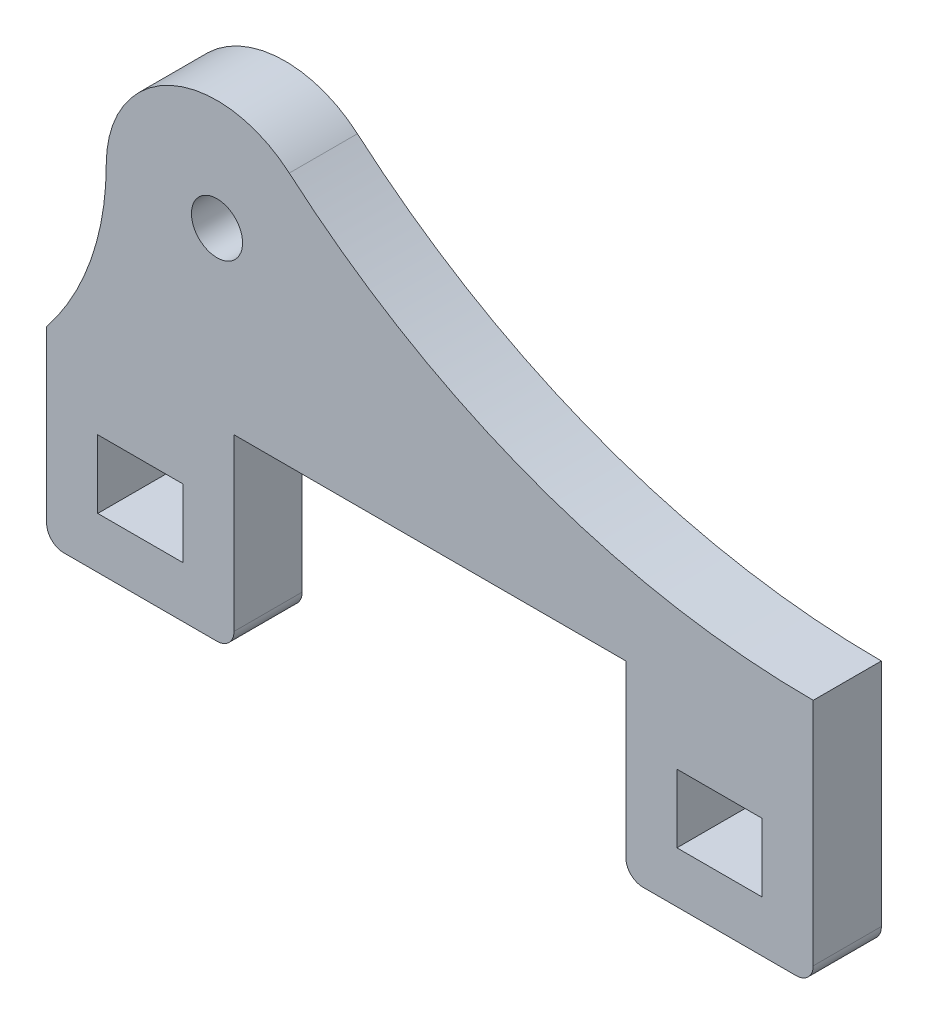
ISO-10303-21;
HEADER;
FILE_DESCRIPTION(('STEP AP214'),'2;1');
FILE_NAME('part.step','',(''),(''),'','','');
FILE_SCHEMA(('AUTOMOTIVE_DESIGN { 1 0 10303 214 1 1 1 1 }'));
ENDSEC;
DATA;
#1=APPLICATION_CONTEXT('core data for automotive mechanical design processes');
#2=APPLICATION_PROTOCOL_DEFINITION('international standard','automotive_design',2000,#1);
#3=PRODUCT_CONTEXT('',#1,'mechanical');
#4=PRODUCT('Part','Part','',(#3));
#5=PRODUCT_RELATED_PRODUCT_CATEGORY('part','',(#4));
#6=PRODUCT_DEFINITION_FORMATION('','',#4);
#7=PRODUCT_DEFINITION_CONTEXT('part definition',#1,'design');
#8=PRODUCT_DEFINITION('design','',#6,#7);
#9=PRODUCT_DEFINITION_SHAPE('','',#8);
#10=(LENGTH_UNIT() NAMED_UNIT(*) SI_UNIT(.MILLI.,.METRE.));
#11=(NAMED_UNIT(*) PLANE_ANGLE_UNIT() SI_UNIT($,.RADIAN.));
#12=(NAMED_UNIT(*) SI_UNIT($,.STERADIAN.) SOLID_ANGLE_UNIT());
#13=UNCERTAINTY_MEASURE_WITH_UNIT(LENGTH_MEASURE(1.E-05),#10,'distance_accuracy_value','');
#14=(GEOMETRIC_REPRESENTATION_CONTEXT(3) GLOBAL_UNCERTAINTY_ASSIGNED_CONTEXT((#13)) GLOBAL_UNIT_ASSIGNED_CONTEXT((#10,
#11,#12)) REPRESENTATION_CONTEXT('',''));
#15=CARTESIAN_POINT('',(0.,0.,0.));
#16=DIRECTION('',(0.,0.,1.));
#17=DIRECTION('',(1.,0.,0.));
#18=AXIS2_PLACEMENT_3D('',#15,#16,#17);
#19=CARTESIAN_POINT('',(0.,-4.,4.));
#20=DIRECTION('',(0.,1.,0.));
#21=DIRECTION('',(0.,0.,1.));
#22=AXIS2_PLACEMENT_3D('',#19,#20,#21);
#23=PLANE('',#22);
#24=DIRECTION('',(1.,0.,0.));
#25=VECTOR('',#24,1.);
#26=CARTESIAN_POINT('',(0.,-4.,0.));
#27=LINE('',#26,#25);
#28=CARTESIAN_POINT('',(3.,-4.,0.));
#29=VERTEX_POINT('',#28);
#30=CARTESIAN_POINT('',(8.,-4.,0.));
#31=VERTEX_POINT('',#30);
#32=EDGE_CURVE('E345',#29,#31,#27,.T.);
#33=ORIENTED_EDGE('',*,*,#32,.T.);
#34=DIRECTION('',(0.,0.,-1.));
#35=VECTOR('',#34,1.);
#36=CARTESIAN_POINT('',(8.,-4.,4.));
#37=LINE('',#36,#35);
#38=CARTESIAN_POINT('',(8.,-4.,4.));
#39=VERTEX_POINT('',#38);
#40=EDGE_CURVE('E239',#39,#31,#37,.T.);
#41=ORIENTED_EDGE('',*,*,#40,.F.);
#42=DIRECTION('',(1.,0.,0.));
#43=VECTOR('',#42,1.);
#44=CARTESIAN_POINT('',(0.,-4.,4.));
#45=LINE('',#44,#43);
#46=CARTESIAN_POINT('',(3.,-4.,4.));
#47=VERTEX_POINT('',#46);
#48=EDGE_CURVE('E443',#47,#39,#45,.T.);
#49=ORIENTED_EDGE('',*,*,#48,.F.);
#50=DIRECTION('',(0.,0.,-1.));
#51=VECTOR('',#50,1.);
#52=CARTESIAN_POINT('',(3.,-4.,4.));
#53=LINE('',#52,#51);
#54=EDGE_CURVE('E361',#47,#29,#53,.T.);
#55=ORIENTED_EDGE('',*,*,#54,.T.);
#56=EDGE_LOOP('',(#33,#41,#49,#55));
#57=FACE_BOUND('',#56,.T.);
#58=ADVANCED_FACE('F41',(#57),#23,.F.);
#59=CARTESIAN_POINT('',(8.,0.,4.));
#60=DIRECTION('',(1.,0.,0.));
#61=DIRECTION('',(0.,0.,-1.));
#62=AXIS2_PLACEMENT_3D('',#59,#60,#61);
#63=PLANE('',#62);
#64=DIRECTION('',(0.,-1.,0.));
#65=VECTOR('',#64,1.);
#66=CARTESIAN_POINT('',(8.,0.,0.));
#67=LINE('',#66,#65);
#68=CARTESIAN_POINT('',(8.,-8.,0.));
#69=VERTEX_POINT('',#68);
#70=EDGE_CURVE('E349',#31,#69,#67,.T.);
#71=ORIENTED_EDGE('',*,*,#70,.T.);
#72=DIRECTION('',(0.,0.,-1.));
#73=VECTOR('',#72,1.);
#74=CARTESIAN_POINT('',(8.,-8.,4.));
#75=LINE('',#74,#73);
#76=CARTESIAN_POINT('',(8.,-8.,4.));
#77=VERTEX_POINT('',#76);
#78=EDGE_CURVE('E368',#77,#69,#75,.T.);
#79=ORIENTED_EDGE('',*,*,#78,.F.);
#80=DIRECTION('',(0.,-1.,0.));
#81=VECTOR('',#80,1.);
#82=CARTESIAN_POINT('',(8.,0.,4.));
#83=LINE('',#82,#81);
#84=EDGE_CURVE('E447',#39,#77,#83,.T.);
#85=ORIENTED_EDGE('',*,*,#84,.F.);
#86=ORIENTED_EDGE('',*,*,#40,.T.);
#87=EDGE_LOOP('',(#71,#79,#85,#86));
#88=FACE_BOUND('',#87,.T.);
#89=ADVANCED_FACE('F484',(#88),#63,.F.);
#90=CARTESIAN_POINT('',(0.,-8.,4.));
#91=DIRECTION('',(0.,1.,0.));
#92=DIRECTION('',(0.,0.,1.));
#93=AXIS2_PLACEMENT_3D('',#90,#91,#92);
#94=PLANE('',#93);
#95=DIRECTION('',(1.,0.,0.));
#96=VECTOR('',#95,1.);
#97=CARTESIAN_POINT('',(0.,-8.,0.));
#98=LINE('',#97,#96);
#99=CARTESIAN_POINT('',(3.,-8.,0.));
#100=VERTEX_POINT('',#99);
#101=EDGE_CURVE('E353',#100,#69,#98,.T.);
#102=ORIENTED_EDGE('',*,*,#101,.F.);
#103=DIRECTION('',(0.,0.,-1.));
#104=VECTOR('',#103,1.);
#105=CARTESIAN_POINT('',(3.,-8.,4.));
#106=LINE('',#105,#104);
#107=CARTESIAN_POINT('',(3.,-8.,4.));
#108=VERTEX_POINT('',#107);
#109=EDGE_CURVE('E364',#108,#100,#106,.T.);
#110=ORIENTED_EDGE('',*,*,#109,.F.);
#111=DIRECTION('',(1.,0.,0.));
#112=VECTOR('',#111,1.);
#113=CARTESIAN_POINT('',(0.,-8.,4.));
#114=LINE('',#113,#112);
#115=EDGE_CURVE('E450',#108,#77,#114,.T.);
#116=ORIENTED_EDGE('',*,*,#115,.T.);
#117=ORIENTED_EDGE('',*,*,#78,.T.);
#118=EDGE_LOOP('',(#102,#110,#116,#117));
#119=FACE_BOUND('',#118,.T.);
#120=ADVANCED_FACE('F490',(#119),#94,.T.);
#121=CARTESIAN_POINT('',(0.,-4.,4.));
#122=DIRECTION('',(0.,1.,0.));
#123=DIRECTION('',(0.,0.,1.));
#124=AXIS2_PLACEMENT_3D('',#121,#122,#123);
#125=PLANE('',#124);
#126=DIRECTION('',(1.,0.,0.));
#127=VECTOR('',#126,1.);
#128=CARTESIAN_POINT('',(0.,-4.,0.));
#129=LINE('',#128,#127);
#130=CARTESIAN_POINT('',(37.,-4.,0.));
#131=VERTEX_POINT('',#130);
#132=CARTESIAN_POINT('',(42.,-4.,0.));
#133=VERTEX_POINT('',#132);
#134=EDGE_CURVE('E329',#131,#133,#129,.T.);
#135=ORIENTED_EDGE('',*,*,#134,.T.);
#136=DIRECTION('',(0.,0.,-1.));
#137=VECTOR('',#136,1.);
#138=CARTESIAN_POINT('',(42.,-4.,4.));
#139=LINE('',#138,#137);
#140=CARTESIAN_POINT('',(42.,-4.,4.));
#141=VERTEX_POINT('',#140);
#142=EDGE_CURVE('E365',#141,#133,#139,.T.);
#143=ORIENTED_EDGE('',*,*,#142,.F.);
#144=DIRECTION('',(1.,0.,0.));
#145=VECTOR('',#144,1.);
#146=CARTESIAN_POINT('',(0.,-4.,4.));
#147=LINE('',#146,#145);
#148=CARTESIAN_POINT('',(37.,-4.,4.));
#149=VERTEX_POINT('',#148);
#150=EDGE_CURVE('E428',#149,#141,#147,.T.);
#151=ORIENTED_EDGE('',*,*,#150,.F.);
#152=DIRECTION('',(0.,0.,-1.));
#153=VECTOR('',#152,1.);
#154=CARTESIAN_POINT('',(37.,-4.,4.));
#155=LINE('',#154,#153);
#156=EDGE_CURVE('E224',#149,#131,#155,.T.);
#157=ORIENTED_EDGE('',*,*,#156,.T.);
#158=EDGE_LOOP('',(#135,#143,#151,#157));
#159=FACE_BOUND('',#158,.T.);
#160=ADVANCED_FACE('F506',(#159),#125,.F.);
#161=CARTESIAN_POINT('',(42.,0.,4.));
#162=DIRECTION('',(1.,0.,0.));
#163=DIRECTION('',(0.,0.,-1.));
#164=AXIS2_PLACEMENT_3D('',#161,#162,#163);
#165=PLANE('',#164);
#166=DIRECTION('',(0.,-1.,0.));
#167=VECTOR('',#166,1.);
#168=CARTESIAN_POINT('',(42.,0.,0.));
#169=LINE('',#168,#167);
#170=CARTESIAN_POINT('',(42.,-8.,0.));
#171=VERTEX_POINT('',#170);
#172=EDGE_CURVE('E333',#133,#171,#169,.T.);
#173=ORIENTED_EDGE('',*,*,#172,.T.);
#174=DIRECTION('',(0.,0.,-1.));
#175=VECTOR('',#174,1.);
#176=CARTESIAN_POINT('',(42.,-8.,4.));
#177=LINE('',#176,#175);
#178=CARTESIAN_POINT('',(42.,-8.,4.));
#179=VERTEX_POINT('',#178);
#180=EDGE_CURVE('E376',#179,#171,#177,.T.);
#181=ORIENTED_EDGE('',*,*,#180,.F.);
#182=DIRECTION('',(0.,-1.,0.));
#183=VECTOR('',#182,1.);
#184=CARTESIAN_POINT('',(42.,0.,4.));
#185=LINE('',#184,#183);
#186=EDGE_CURVE('E432',#141,#179,#185,.T.);
#187=ORIENTED_EDGE('',*,*,#186,.F.);
#188=ORIENTED_EDGE('',*,*,#142,.T.);
#189=EDGE_LOOP('',(#173,#181,#187,#188));
#190=FACE_BOUND('',#189,.T.);
#191=ADVANCED_FACE('F502',(#190),#165,.F.);
#192=CARTESIAN_POINT('',(0.,-8.,4.));
#193=DIRECTION('',(0.,1.,0.));
#194=DIRECTION('',(0.,0.,1.));
#195=AXIS2_PLACEMENT_3D('',#192,#193,#194);
#196=PLANE('',#195);
#197=DIRECTION('',(1.,0.,0.));
#198=VECTOR('',#197,1.);
#199=CARTESIAN_POINT('',(0.,-8.,0.));
#200=LINE('',#199,#198);
#201=CARTESIAN_POINT('',(37.,-8.,0.));
#202=VERTEX_POINT('',#201);
#203=EDGE_CURVE('E337',#202,#171,#200,.T.);
#204=ORIENTED_EDGE('',*,*,#203,.F.);
#205=DIRECTION('',(0.,0.,-1.));
#206=VECTOR('',#205,1.);
#207=CARTESIAN_POINT('',(37.,-8.,4.));
#208=LINE('',#207,#206);
#209=CARTESIAN_POINT('',(37.,-8.,4.));
#210=VERTEX_POINT('',#209);
#211=EDGE_CURVE('E228',#210,#202,#208,.T.);
#212=ORIENTED_EDGE('',*,*,#211,.F.);
#213=DIRECTION('',(1.,0.,0.));
#214=VECTOR('',#213,1.);
#215=CARTESIAN_POINT('',(0.,-8.,4.));
#216=LINE('',#215,#214);
#217=EDGE_CURVE('E435',#210,#179,#216,.T.);
#218=ORIENTED_EDGE('',*,*,#217,.T.);
#219=ORIENTED_EDGE('',*,*,#180,.T.);
#220=EDGE_LOOP('',(#204,#212,#218,#219));
#221=FACE_BOUND('',#220,.T.);
#222=ADVANCED_FACE('F499',(#221),#196,.T.);
#223=CARTESIAN_POINT('',(10.,10.,4.));
#224=DIRECTION('',(0.,0.,-1.));
#225=DIRECTION('',(-1.,0.,0.));
#226=AXIS2_PLACEMENT_3D('',#223,#224,#225);
#227=CYLINDRICAL_SURFACE('',#226,6.5);
#228=CARTESIAN_POINT('',(10.,10.,0.));
#229=DIRECTION('',(0.,0.,1.));
#230=DIRECTION('',(1.,0.,0.));
#231=AXIS2_PLACEMENT_3D('',#228,#229,#230);
#232=CIRCLE('',#231,6.5);
#233=CARTESIAN_POINT('',(14.2431850789096,14.9239598278336,0.));
#234=VERTEX_POINT('',#233);
#235=CARTESIAN_POINT('',(3.5,10.,0.));
#236=VERTEX_POINT('',#235);
#237=EDGE_CURVE('E222',#234,#236,#232,.T.);
#238=ORIENTED_EDGE('',*,*,#237,.T.);
#239=DIRECTION('',(0.,0.,-1.));
#240=VECTOR('',#239,1.);
#241=CARTESIAN_POINT('',(3.5,10.,4.));
#242=LINE('',#241,#240);
#243=CARTESIAN_POINT('',(3.5,10.,4.));
#244=VERTEX_POINT('',#243);
#245=EDGE_CURVE('E198',#244,#236,#242,.T.);
#246=ORIENTED_EDGE('',*,*,#245,.F.);
#247=CARTESIAN_POINT('',(10.,10.,4.));
#248=DIRECTION('',(0.,0.,1.));
#249=DIRECTION('',(1.,0.,0.));
#250=AXIS2_PLACEMENT_3D('',#247,#248,#249);
#251=CIRCLE('',#250,6.5);
#252=CARTESIAN_POINT('',(14.2431850789096,14.9239598278336,4.));
#253=VERTEX_POINT('',#252);
#254=EDGE_CURVE('E206',#253,#244,#251,.T.);
#255=ORIENTED_EDGE('',*,*,#254,.F.);
#256=DIRECTION('',(0.,0.,-1.));
#257=VECTOR('',#256,1.);
#258=CARTESIAN_POINT('',(14.2431850789096,14.9239598278336,4.));
#259=LINE('',#258,#257);
#260=EDGE_CURVE('E382',#253,#234,#259,.T.);
#261=ORIENTED_EDGE('',*,*,#260,.T.);
#262=EDGE_LOOP('',(#238,#246,#255,#261));
#263=FACE_BOUND('',#262,.T.);
#264=ADVANCED_FACE('F220',(#263),#227,.T.);
#265=CARTESIAN_POINT('',(-12.5357142857143,9.99999999999999,4.));
#266=DIRECTION('',(0.,0.,-1.));
#267=DIRECTION('',(-1.,0.,0.));
#268=AXIS2_PLACEMENT_3D('',#265,#266,#267);
#269=CYLINDRICAL_SURFACE('',#268,16.0357142857143);
#270=CARTESIAN_POINT('',(-12.5357142857143,9.99999999999999,0.));
#271=DIRECTION('',(0.,0.,1.));
#272=DIRECTION('',(1.,0.,0.));
#273=AXIS2_PLACEMENT_3D('',#270,#271,#272);
#274=CIRCLE('',#273,16.0357142857143);
#275=CARTESIAN_POINT('',(0.,0.,0.));
#276=VERTEX_POINT('',#275);
#277=EDGE_CURVE('E310',#236,#276,#274,.F.);
#278=ORIENTED_EDGE('',*,*,#277,.T.);
#279=DIRECTION('',(0.,0.,-1.));
#280=VECTOR('',#279,1.);
#281=CARTESIAN_POINT('',(0.,0.,4.));
#282=LINE('',#281,#280);
#283=CARTESIAN_POINT('',(0.,0.,4.));
#284=VERTEX_POINT('',#283);
#285=EDGE_CURVE('E201',#284,#276,#282,.T.);
#286=ORIENTED_EDGE('',*,*,#285,.F.);
#287=CARTESIAN_POINT('',(-12.5357142857143,9.99999999999999,4.));
#288=DIRECTION('',(0.,0.,1.));
#289=DIRECTION('',(1.,0.,0.));
#290=AXIS2_PLACEMENT_3D('',#287,#288,#289);
#291=CIRCLE('',#290,16.0357142857143);
#292=EDGE_CURVE('E194',#244,#284,#291,.F.);
#293=ORIENTED_EDGE('',*,*,#292,.F.);
#294=ORIENTED_EDGE('',*,*,#245,.T.);
#295=EDGE_LOOP('',(#278,#286,#293,#294));
#296=FACE_BOUND('',#295,.T.);
#297=ADVANCED_FACE('F196',(#296),#269,.F.);
#298=CARTESIAN_POINT('',(0.,0.,4.));
#299=DIRECTION('',(1.,0.,0.));
#300=DIRECTION('',(0.,1.,0.));
#301=AXIS2_PLACEMENT_3D('',#298,#299,#300);
#302=PLANE('',#301);
#303=DIRECTION('',(0.,-1.,0.));
#304=VECTOR('',#303,1.);
#305=CARTESIAN_POINT('',(0.,0.,0.));
#306=LINE('',#305,#304);
#307=CARTESIAN_POINT('',(0.,-10.,0.));
#308=VERTEX_POINT('',#307);
#309=EDGE_CURVE('E283',#276,#308,#306,.T.);
#310=ORIENTED_EDGE('',*,*,#309,.T.);
#311=DIRECTION('',(0.,0.,-1.));
#312=VECTOR('',#311,1.);
#313=CARTESIAN_POINT('',(0.,-10.,4.));
#314=LINE('',#313,#312);
#315=CARTESIAN_POINT('',(0.,-10.,4.));
#316=VERTEX_POINT('',#315);
#317=EDGE_CURVE('E50',#308,#316,#314,.F.);
#318=ORIENTED_EDGE('',*,*,#317,.T.);
#319=DIRECTION('',(0.,-1.,0.));
#320=VECTOR('',#319,1.);
#321=CARTESIAN_POINT('',(0.,0.,4.));
#322=LINE('',#321,#320);
#323=EDGE_CURVE('E205',#284,#316,#322,.T.);
#324=ORIENTED_EDGE('',*,*,#323,.F.);
#325=ORIENTED_EDGE('',*,*,#285,.T.);
#326=EDGE_LOOP('',(#310,#318,#324,#325));
#327=FACE_BOUND('',#326,.T.);
#328=ADVANCED_FACE('F281',(#327),#302,.F.);
#329=CARTESIAN_POINT('',(0.,-11.,4.));
#330=DIRECTION('',(0.,1.,0.));
#331=DIRECTION('',(0.,0.,1.));
#332=AXIS2_PLACEMENT_3D('',#329,#330,#331);
#333=PLANE('',#332);
#334=DIRECTION('',(1.,0.,0.));
#335=VECTOR('',#334,1.);
#336=CARTESIAN_POINT('',(0.,-11.,4.));
#337=LINE('',#336,#335);
#338=CARTESIAN_POINT('',(1.,-11.,4.));
#339=VERTEX_POINT('',#338);
#340=CARTESIAN_POINT('',(10.,-11.,4.));
#341=VERTEX_POINT('',#340);
#342=EDGE_CURVE('E288',#339,#341,#337,.T.);
#343=ORIENTED_EDGE('',*,*,#342,.F.);
#344=DIRECTION('',(0.,0.,-1.));
#345=VECTOR('',#344,1.);
#346=CARTESIAN_POINT('',(1.,-11.,4.));
#347=LINE('',#346,#345);
#348=CARTESIAN_POINT('',(1.,-11.,0.));
#349=VERTEX_POINT('',#348);
#350=EDGE_CURVE('E274',#339,#349,#347,.T.);
#351=ORIENTED_EDGE('',*,*,#350,.T.);
#352=DIRECTION('',(1.,0.,0.));
#353=VECTOR('',#352,1.);
#354=CARTESIAN_POINT('',(0.,-11.,0.));
#355=LINE('',#354,#353);
#356=CARTESIAN_POINT('',(10.,-11.,0.));
#357=VERTEX_POINT('',#356);
#358=EDGE_CURVE('E296',#349,#357,#355,.T.);
#359=ORIENTED_EDGE('',*,*,#358,.T.);
#360=DIRECTION('',(0.,0.,-1.));
#361=VECTOR('',#360,1.);
#362=CARTESIAN_POINT('',(10.,-11.,4.));
#363=LINE('',#362,#361);
#364=EDGE_CURVE('E271',#357,#341,#363,.F.);
#365=ORIENTED_EDGE('',*,*,#364,.T.);
#366=EDGE_LOOP('',(#343,#351,#359,#365));
#367=FACE_BOUND('',#366,.T.);
#368=ADVANCED_FACE('F295',(#367),#333,.F.);
#369=CARTESIAN_POINT('',(11.,0.,4.));
#370=DIRECTION('',(-1.,0.,0.));
#371=DIRECTION('',(0.,0.,1.));
#372=AXIS2_PLACEMENT_3D('',#369,#370,#371);
#373=PLANE('',#372);
#374=DIRECTION('',(0.,1.,0.));
#375=VECTOR('',#374,1.);
#376=CARTESIAN_POINT('',(11.,0.,4.));
#377=LINE('',#376,#375);
#378=CARTESIAN_POINT('',(11.,-10.,4.));
#379=VERTEX_POINT('',#378);
#380=CARTESIAN_POINT('',(11.,0.,4.));
#381=VERTEX_POINT('',#380);
#382=EDGE_CURVE('E550',#379,#381,#377,.T.);
#383=ORIENTED_EDGE('',*,*,#382,.F.);
#384=DIRECTION('',(0.,0.,-1.));
#385=VECTOR('',#384,1.);
#386=CARTESIAN_POINT('',(11.,-10.,4.));
#387=LINE('',#386,#385);
#388=CARTESIAN_POINT('',(11.,-10.,0.));
#389=VERTEX_POINT('',#388);
#390=EDGE_CURVE('E11',#379,#389,#387,.T.);
#391=ORIENTED_EDGE('',*,*,#390,.T.);
#392=DIRECTION('',(0.,1.,0.));
#393=VECTOR('',#392,1.);
#394=CARTESIAN_POINT('',(11.,0.,0.));
#395=LINE('',#394,#393);
#396=CARTESIAN_POINT('',(11.,0.,0.));
#397=VERTEX_POINT('',#396);
#398=EDGE_CURVE('E304',#389,#397,#395,.T.);
#399=ORIENTED_EDGE('',*,*,#398,.T.);
#400=DIRECTION('',(0.,0.,-1.));
#401=VECTOR('',#400,1.);
#402=CARTESIAN_POINT('',(11.,0.,4.));
#403=LINE('',#402,#401);
#404=EDGE_CURVE('E230',#381,#397,#403,.T.);
#405=ORIENTED_EDGE('',*,*,#404,.F.);
#406=EDGE_LOOP('',(#383,#391,#399,#405));
#407=FACE_BOUND('',#406,.T.);
#408=ADVANCED_FACE('F522',(#407),#373,.F.);
#409=CARTESIAN_POINT('',(0.,0.,4.));
#410=DIRECTION('',(0.,1.,0.));
#411=DIRECTION('',(0.,0.,1.));
#412=AXIS2_PLACEMENT_3D('',#409,#410,#411);
#413=PLANE('',#412);
#414=DIRECTION('',(1.,0.,0.));
#415=VECTOR('',#414,1.);
#416=CARTESIAN_POINT('',(0.,0.,0.));
#417=LINE('',#416,#415);
#418=CARTESIAN_POINT('',(34.,0.,0.));
#419=VERTEX_POINT('',#418);
#420=EDGE_CURVE('E308',#397,#419,#417,.T.);
#421=ORIENTED_EDGE('',*,*,#420,.T.);
#422=DIRECTION('',(0.,0.,-1.));
#423=VECTOR('',#422,1.);
#424=CARTESIAN_POINT('',(34.,0.,4.));
#425=LINE('',#424,#423);
#426=CARTESIAN_POINT('',(34.,0.,4.));
#427=VERTEX_POINT('',#426);
#428=EDGE_CURVE('E390',#427,#419,#425,.T.);
#429=ORIENTED_EDGE('',*,*,#428,.F.);
#430=DIRECTION('',(1.,0.,0.));
#431=VECTOR('',#430,1.);
#432=CARTESIAN_POINT('',(0.,0.,4.));
#433=LINE('',#432,#431);
#434=EDGE_CURVE('E401',#381,#427,#433,.T.);
#435=ORIENTED_EDGE('',*,*,#434,.F.);
#436=ORIENTED_EDGE('',*,*,#404,.T.);
#437=EDGE_LOOP('',(#421,#429,#435,#436));
#438=FACE_BOUND('',#437,.T.);
#439=ADVANCED_FACE('F399',(#438),#413,.F.);
#440=CARTESIAN_POINT('',(34.,0.,4.));
#441=DIRECTION('',(1.,0.,0.));
#442=DIRECTION('',(0.,0.,-1.));
#443=AXIS2_PLACEMENT_3D('',#440,#441,#442);
#444=PLANE('',#443);
#445=DIRECTION('',(0.,-1.,0.));
#446=VECTOR('',#445,1.);
#447=CARTESIAN_POINT('',(34.,0.,0.));
#448=LINE('',#447,#446);
#449=CARTESIAN_POINT('',(34.,-10.,0.));
#450=VERTEX_POINT('',#449);
#451=EDGE_CURVE('E316',#419,#450,#448,.T.);
#452=ORIENTED_EDGE('',*,*,#451,.T.);
#453=DIRECTION('',(0.,0.,-1.));
#454=VECTOR('',#453,1.);
#455=CARTESIAN_POINT('',(34.,-10.,4.));
#456=LINE('',#455,#454);
#457=CARTESIAN_POINT('',(34.,-10.,4.));
#458=VERTEX_POINT('',#457);
#459=EDGE_CURVE('E57',#450,#458,#456,.F.);
#460=ORIENTED_EDGE('',*,*,#459,.T.);
#461=DIRECTION('',(0.,-1.,0.));
#462=VECTOR('',#461,1.);
#463=CARTESIAN_POINT('',(34.,0.,4.));
#464=LINE('',#463,#462);
#465=EDGE_CURVE('E413',#427,#458,#464,.T.);
#466=ORIENTED_EDGE('',*,*,#465,.F.);
#467=ORIENTED_EDGE('',*,*,#428,.T.);
#468=EDGE_LOOP('',(#452,#460,#466,#467));
#469=FACE_BOUND('',#468,.T.);
#470=ADVANCED_FACE('F405',(#469),#444,.F.);
#471=CARTESIAN_POINT('',(0.,-11.,4.));
#472=DIRECTION('',(0.,1.,0.));
#473=DIRECTION('',(0.,0.,1.));
#474=AXIS2_PLACEMENT_3D('',#471,#472,#473);
#475=PLANE('',#474);
#476=DIRECTION('',(1.,0.,0.));
#477=VECTOR('',#476,1.);
#478=CARTESIAN_POINT('',(0.,-11.,0.));
#479=LINE('',#478,#477);
#480=CARTESIAN_POINT('',(35.,-11.,0.));
#481=VERTEX_POINT('',#480);
#482=CARTESIAN_POINT('',(44.,-11.,0.));
#483=VERTEX_POINT('',#482);
#484=EDGE_CURVE('E319',#481,#483,#479,.T.);
#485=ORIENTED_EDGE('',*,*,#484,.T.);
#486=DIRECTION('',(0.,0.,-1.));
#487=VECTOR('',#486,1.);
#488=CARTESIAN_POINT('',(44.,-11.,4.));
#489=LINE('',#488,#487);
#490=CARTESIAN_POINT('',(44.,-11.,4.));
#491=VERTEX_POINT('',#490);
#492=EDGE_CURVE('E255',#483,#491,#489,.F.);
#493=ORIENTED_EDGE('',*,*,#492,.T.);
#494=DIRECTION('',(1.,0.,0.));
#495=VECTOR('',#494,1.);
#496=CARTESIAN_POINT('',(0.,-11.,4.));
#497=LINE('',#496,#495);
#498=CARTESIAN_POINT('',(35.,-11.,4.));
#499=VERTEX_POINT('',#498);
#500=EDGE_CURVE('E411',#499,#491,#497,.T.);
#501=ORIENTED_EDGE('',*,*,#500,.F.);
#502=DIRECTION('',(0.,0.,-1.));
#503=VECTOR('',#502,1.);
#504=CARTESIAN_POINT('',(35.,-11.,4.));
#505=LINE('',#504,#503);
#506=EDGE_CURVE('E251',#499,#481,#505,.T.);
#507=ORIENTED_EDGE('',*,*,#506,.T.);
#508=EDGE_LOOP('',(#485,#493,#501,#507));
#509=FACE_BOUND('',#508,.T.);
#510=ADVANCED_FACE('F415',(#509),#475,.F.);
#511=CARTESIAN_POINT('',(45.,0.,4.));
#512=DIRECTION('',(-1.,0.,0.));
#513=DIRECTION('',(0.,0.,1.));
#514=AXIS2_PLACEMENT_3D('',#511,#512,#513);
#515=PLANE('',#514);
#516=DIRECTION('',(0.,1.,0.));
#517=VECTOR('',#516,1.);
#518=CARTESIAN_POINT('',(45.,0.,4.));
#519=LINE('',#518,#517);
#520=CARTESIAN_POINT('',(45.,-10.,4.));
#521=VERTEX_POINT('',#520);
#522=CARTESIAN_POINT('',(45.,3.5,4.));
#523=VERTEX_POINT('',#522);
#524=EDGE_CURVE('E418',#521,#523,#519,.T.);
#525=ORIENTED_EDGE('',*,*,#524,.F.);
#526=DIRECTION('',(0.,0.,-1.));
#527=VECTOR('',#526,1.);
#528=CARTESIAN_POINT('',(45.,-10.,4.));
#529=LINE('',#528,#527);
#530=CARTESIAN_POINT('',(45.,-10.,0.));
#531=VERTEX_POINT('',#530);
#532=EDGE_CURVE('E234',#521,#531,#529,.T.);
#533=ORIENTED_EDGE('',*,*,#532,.T.);
#534=DIRECTION('',(0.,1.,0.));
#535=VECTOR('',#534,1.);
#536=CARTESIAN_POINT('',(45.,0.,0.));
#537=LINE('',#536,#535);
#538=CARTESIAN_POINT('',(45.,3.5,0.));
#539=VERTEX_POINT('',#538);
#540=EDGE_CURVE('E323',#531,#539,#537,.T.);
#541=ORIENTED_EDGE('',*,*,#540,.T.);
#542=DIRECTION('',(0.,0.,-1.));
#543=VECTOR('',#542,1.);
#544=CARTESIAN_POINT('',(45.,3.5,4.));
#545=LINE('',#544,#543);
#546=EDGE_CURVE('E385',#523,#539,#545,.T.);
#547=ORIENTED_EDGE('',*,*,#546,.F.);
#548=EDGE_LOOP('',(#525,#533,#541,#547));
#549=FACE_BOUND('',#548,.T.);
#550=ADVANCED_FACE('F469',(#549),#515,.F.);
#551=CARTESIAN_POINT('',(37.,0.,4.));
#552=DIRECTION('',(1.,0.,0.));
#553=DIRECTION('',(0.,0.,-1.));
#554=AXIS2_PLACEMENT_3D('',#551,#552,#553);
#555=PLANE('',#554);
#556=DIRECTION('',(0.,-1.,0.));
#557=VECTOR('',#556,1.);
#558=CARTESIAN_POINT('',(37.,0.,0.));
#559=LINE('',#558,#557);
#560=EDGE_CURVE('E341',#131,#202,#559,.T.);
#561=ORIENTED_EDGE('',*,*,#560,.F.);
#562=ORIENTED_EDGE('',*,*,#156,.F.);
#563=DIRECTION('',(0.,-1.,0.));
#564=VECTOR('',#563,1.);
#565=CARTESIAN_POINT('',(37.,0.,4.));
#566=LINE('',#565,#564);
#567=EDGE_CURVE('E439',#149,#210,#566,.T.);
#568=ORIENTED_EDGE('',*,*,#567,.T.);
#569=ORIENTED_EDGE('',*,*,#211,.T.);
#570=EDGE_LOOP('',(#561,#562,#568,#569));
#571=FACE_BOUND('',#570,.T.);
#572=ADVANCED_FACE('F495',(#571),#555,.T.);
#573=CARTESIAN_POINT('',(45.,50.6153846153846,4.));
#574=DIRECTION('',(0.,0.,-1.));
#575=DIRECTION('',(-1.,0.,0.));
#576=AXIS2_PLACEMENT_3D('',#573,#574,#575);
#577=CYLINDRICAL_SURFACE('',#576,47.1153846153846);
#578=CARTESIAN_POINT('',(45.,50.6153846153846,0.));
#579=DIRECTION('',(0.,0.,1.));
#580=DIRECTION('',(1.,0.,0.));
#581=AXIS2_PLACEMENT_3D('',#578,#579,#580);
#582=CIRCLE('',#581,47.1153846153846);
#583=EDGE_CURVE('E326',#539,#234,#582,.F.);
#584=ORIENTED_EDGE('',*,*,#583,.T.);
#585=ORIENTED_EDGE('',*,*,#260,.F.);
#586=CARTESIAN_POINT('',(45.,50.6153846153846,4.));
#587=DIRECTION('',(0.,0.,1.));
#588=DIRECTION('',(1.,0.,0.));
#589=AXIS2_PLACEMENT_3D('',#586,#587,#588);
#590=CIRCLE('',#589,47.1153846153846);
#591=EDGE_CURVE('E213',#523,#253,#590,.F.);
#592=ORIENTED_EDGE('',*,*,#591,.F.);
#593=ORIENTED_EDGE('',*,*,#546,.T.);
#594=EDGE_LOOP('',(#584,#585,#592,#593));
#595=FACE_BOUND('',#594,.T.);
#596=ADVANCED_FACE('F465',(#595),#577,.F.);
#597=CARTESIAN_POINT('',(10.,10.,4.));
#598=DIRECTION('',(0.,0.,-1.));
#599=DIRECTION('',(-1.,0.,0.));
#600=AXIS2_PLACEMENT_3D('',#597,#598,#599);
#601=CYLINDRICAL_SURFACE('',#600,1.5);
#602=CARTESIAN_POINT('',(10.,10.,4.));
#603=DIRECTION('',(0.,0.,1.));
#604=DIRECTION('',(1.,0.,0.));
#605=AXIS2_PLACEMENT_3D('',#602,#603,#604);
#606=CIRCLE('',#605,1.5);
#607=CARTESIAN_POINT('',(11.5,10.,4.));
#608=VERTEX_POINT('',#607);
#609=EDGE_CURVE('E218',#608,#608,#606,.T.);
#610=ORIENTED_EDGE('',*,*,#609,.T.);
#611=EDGE_LOOP('',(#610));
#612=FACE_BOUND('',#611,.T.);
#613=CARTESIAN_POINT('',(10.,10.,0.));
#614=DIRECTION('',(0.,0.,1.));
#615=DIRECTION('',(1.,0.,0.));
#616=AXIS2_PLACEMENT_3D('',#613,#614,#615);
#617=CIRCLE('',#616,1.5);
#618=CARTESIAN_POINT('',(11.5,10.,0.));
#619=VERTEX_POINT('',#618);
#620=EDGE_CURVE('E457',#619,#619,#617,.T.);
#621=ORIENTED_EDGE('',*,*,#620,.F.);
#622=EDGE_LOOP('',(#621));
#623=FACE_BOUND('',#622,.T.);
#624=ADVANCED_FACE('F513',(#612,#623),#601,.F.);
#625=CARTESIAN_POINT('',(3.,0.,4.));
#626=DIRECTION('',(1.,0.,0.));
#627=DIRECTION('',(0.,1.,0.));
#628=AXIS2_PLACEMENT_3D('',#625,#626,#627);
#629=PLANE('',#628);
#630=DIRECTION('',(0.,-1.,0.));
#631=VECTOR('',#630,1.);
#632=CARTESIAN_POINT('',(3.,0.,0.));
#633=LINE('',#632,#631);
#634=EDGE_CURVE('E357',#29,#100,#633,.T.);
#635=ORIENTED_EDGE('',*,*,#634,.F.);
#636=ORIENTED_EDGE('',*,*,#54,.F.);
#637=DIRECTION('',(0.,-1.,0.));
#638=VECTOR('',#637,1.);
#639=CARTESIAN_POINT('',(3.,0.,4.));
#640=LINE('',#639,#638);
#641=EDGE_CURVE('E386',#47,#108,#640,.T.);
#642=ORIENTED_EDGE('',*,*,#641,.T.);
#643=ORIENTED_EDGE('',*,*,#109,.T.);
#644=EDGE_LOOP('',(#635,#636,#642,#643));
#645=FACE_BOUND('',#644,.T.);
#646=ADVANCED_FACE('F533',(#645),#629,.T.);
#647=CARTESIAN_POINT('',(0.,0.,4.));
#648=DIRECTION('',(0.,0.,1.));
#649=DIRECTION('',(1.,0.,0.));
#650=AXIS2_PLACEMENT_3D('',#647,#648,#649);
#651=PLANE('',#650);
#652=ORIENTED_EDGE('',*,*,#609,.F.);
#653=EDGE_LOOP('',(#652));
#654=FACE_BOUND('',#653,.T.);
#655=ORIENTED_EDGE('',*,*,#500,.T.);
#656=CARTESIAN_POINT('',(44.,-10.,4.));
#657=DIRECTION('',(0.,0.,1.));
#658=DIRECTION('',(1.,0.,0.));
#659=AXIS2_PLACEMENT_3D('',#656,#657,#658);
#660=CIRCLE('',#659,1.);
#661=EDGE_CURVE('E266',#491,#521,#660,.T.);
#662=ORIENTED_EDGE('',*,*,#661,.T.);
#663=ORIENTED_EDGE('',*,*,#524,.T.);
#664=ORIENTED_EDGE('',*,*,#591,.T.);
#665=ORIENTED_EDGE('',*,*,#254,.T.);
#666=ORIENTED_EDGE('',*,*,#292,.T.);
#667=ORIENTED_EDGE('',*,*,#323,.T.);
#668=CARTESIAN_POINT('',(1.,-10.,4.));
#669=DIRECTION('',(0.,0.,1.));
#670=DIRECTION('',(1.,0.,0.));
#671=AXIS2_PLACEMENT_3D('',#668,#669,#670);
#672=CIRCLE('',#671,1.);
#673=EDGE_CURVE('E260',#316,#339,#672,.T.);
#674=ORIENTED_EDGE('',*,*,#673,.T.);
#675=ORIENTED_EDGE('',*,*,#342,.T.);
#676=CARTESIAN_POINT('',(10.,-10.,4.));
#677=DIRECTION('',(0.,0.,1.));
#678=DIRECTION('',(1.,0.,0.));
#679=AXIS2_PLACEMENT_3D('',#676,#677,#678);
#680=CIRCLE('',#679,1.);
#681=EDGE_CURVE('E65',#341,#379,#680,.T.);
#682=ORIENTED_EDGE('',*,*,#681,.T.);
#683=ORIENTED_EDGE('',*,*,#382,.T.);
#684=ORIENTED_EDGE('',*,*,#434,.T.);
#685=ORIENTED_EDGE('',*,*,#465,.T.);
#686=CARTESIAN_POINT('',(35.,-10.,4.));
#687=DIRECTION('',(0.,0.,1.));
#688=DIRECTION('',(1.,0.,0.));
#689=AXIS2_PLACEMENT_3D('',#686,#687,#688);
#690=CIRCLE('',#689,1.);
#691=EDGE_CURVE('E263',#458,#499,#690,.T.);
#692=ORIENTED_EDGE('',*,*,#691,.T.);
#693=EDGE_LOOP('',(#655,#662,#663,#664,#665,#666,#667,#674,#675,#682,#683,#684,#685,#692));
#694=FACE_BOUND('',#693,.T.);
#695=ORIENTED_EDGE('',*,*,#150,.T.);
#696=ORIENTED_EDGE('',*,*,#186,.T.);
#697=ORIENTED_EDGE('',*,*,#217,.F.);
#698=ORIENTED_EDGE('',*,*,#567,.F.);
#699=EDGE_LOOP('',(#695,#696,#697,#698));
#700=FACE_BOUND('',#699,.T.);
#701=ORIENTED_EDGE('',*,*,#48,.T.);
#702=ORIENTED_EDGE('',*,*,#84,.T.);
#703=ORIENTED_EDGE('',*,*,#115,.F.);
#704=ORIENTED_EDGE('',*,*,#641,.F.);
#705=EDGE_LOOP('',(#701,#702,#703,#704));
#706=FACE_BOUND('',#705,.T.);
#707=ADVANCED_FACE('F210',(#654,#694,#700,#706),#651,.T.);
#708=CARTESIAN_POINT('',(0.,0.,0.));
#709=DIRECTION('',(0.,0.,1.));
#710=DIRECTION('',(1.,0.,0.));
#711=AXIS2_PLACEMENT_3D('',#708,#709,#710);
#712=PLANE('',#711);
#713=ORIENTED_EDGE('',*,*,#620,.T.);
#714=EDGE_LOOP('',(#713));
#715=FACE_BOUND('',#714,.T.);
#716=ORIENTED_EDGE('',*,*,#540,.F.);
#717=CARTESIAN_POINT('',(44.,-10.,0.));
#718=DIRECTION('',(0.,0.,1.));
#719=DIRECTION('',(1.,0.,0.));
#720=AXIS2_PLACEMENT_3D('',#717,#718,#719);
#721=CIRCLE('',#720,1.);
#722=EDGE_CURVE('E248',#531,#483,#721,.F.);
#723=ORIENTED_EDGE('',*,*,#722,.T.);
#724=ORIENTED_EDGE('',*,*,#484,.F.);
#725=CARTESIAN_POINT('',(35.,-10.,0.));
#726=DIRECTION('',(0.,0.,1.));
#727=DIRECTION('',(1.,0.,0.));
#728=AXIS2_PLACEMENT_3D('',#725,#726,#727);
#729=CIRCLE('',#728,1.);
#730=EDGE_CURVE('E245',#481,#450,#729,.F.);
#731=ORIENTED_EDGE('',*,*,#730,.T.);
#732=ORIENTED_EDGE('',*,*,#451,.F.);
#733=ORIENTED_EDGE('',*,*,#420,.F.);
#734=ORIENTED_EDGE('',*,*,#398,.F.);
#735=CARTESIAN_POINT('',(10.,-10.,0.));
#736=DIRECTION('',(0.,0.,1.));
#737=DIRECTION('',(1.,0.,0.));
#738=AXIS2_PLACEMENT_3D('',#735,#736,#737);
#739=CIRCLE('',#738,1.);
#740=EDGE_CURVE('E238',#389,#357,#739,.F.);
#741=ORIENTED_EDGE('',*,*,#740,.T.);
#742=ORIENTED_EDGE('',*,*,#358,.F.);
#743=CARTESIAN_POINT('',(1.,-10.,0.));
#744=DIRECTION('',(0.,0.,1.));
#745=DIRECTION('',(1.,0.,0.));
#746=AXIS2_PLACEMENT_3D('',#743,#744,#745);
#747=CIRCLE('',#746,1.);
#748=EDGE_CURVE('E242',#349,#308,#747,.F.);
#749=ORIENTED_EDGE('',*,*,#748,.T.);
#750=ORIENTED_EDGE('',*,*,#309,.F.);
#751=ORIENTED_EDGE('',*,*,#277,.F.);
#752=ORIENTED_EDGE('',*,*,#237,.F.);
#753=ORIENTED_EDGE('',*,*,#583,.F.);
#754=EDGE_LOOP('',(#716,#723,#724,#731,#732,#733,#734,#741,#742,#749,#750,#751,#752,#753));
#755=FACE_BOUND('',#754,.T.);
#756=ORIENTED_EDGE('',*,*,#134,.F.);
#757=ORIENTED_EDGE('',*,*,#560,.T.);
#758=ORIENTED_EDGE('',*,*,#203,.T.);
#759=ORIENTED_EDGE('',*,*,#172,.F.);
#760=EDGE_LOOP('',(#756,#757,#758,#759));
#761=FACE_BOUND('',#760,.T.);
#762=ORIENTED_EDGE('',*,*,#32,.F.);
#763=ORIENTED_EDGE('',*,*,#634,.T.);
#764=ORIENTED_EDGE('',*,*,#101,.T.);
#765=ORIENTED_EDGE('',*,*,#70,.F.);
#766=EDGE_LOOP('',(#762,#763,#764,#765));
#767=FACE_BOUND('',#766,.T.);
#768=ADVANCED_FACE('F300',(#715,#755,#761,#767),#712,.F.);
#769=CARTESIAN_POINT('',(44.,-10.,4.));
#770=DIRECTION('',(0.,0.,-1.));
#771=DIRECTION('',(-1.,0.,0.));
#772=AXIS2_PLACEMENT_3D('',#769,#770,#771);
#773=CYLINDRICAL_SURFACE('',#772,1.);
#774=ORIENTED_EDGE('',*,*,#661,.F.);
#775=ORIENTED_EDGE('',*,*,#492,.F.);
#776=ORIENTED_EDGE('',*,*,#722,.F.);
#777=ORIENTED_EDGE('',*,*,#532,.F.);
#778=EDGE_LOOP('',(#774,#775,#776,#777));
#779=FACE_BOUND('',#778,.T.);
#780=ADVANCED_FACE('F472',(#779),#773,.T.);
#781=CARTESIAN_POINT('',(35.,-10.,4.));
#782=DIRECTION('',(0.,0.,-1.));
#783=DIRECTION('',(-1.,0.,0.));
#784=AXIS2_PLACEMENT_3D('',#781,#782,#783);
#785=CYLINDRICAL_SURFACE('',#784,1.);
#786=ORIENTED_EDGE('',*,*,#691,.F.);
#787=ORIENTED_EDGE('',*,*,#459,.F.);
#788=ORIENTED_EDGE('',*,*,#730,.F.);
#789=ORIENTED_EDGE('',*,*,#506,.F.);
#790=EDGE_LOOP('',(#786,#787,#788,#789));
#791=FACE_BOUND('',#790,.T.);
#792=ADVANCED_FACE('F408',(#791),#785,.T.);
#793=CARTESIAN_POINT('',(1.,-10.,4.));
#794=DIRECTION('',(0.,0.,-1.));
#795=DIRECTION('',(-1.,0.,0.));
#796=AXIS2_PLACEMENT_3D('',#793,#794,#795);
#797=CYLINDRICAL_SURFACE('',#796,1.);
#798=ORIENTED_EDGE('',*,*,#673,.F.);
#799=ORIENTED_EDGE('',*,*,#317,.F.);
#800=ORIENTED_EDGE('',*,*,#748,.F.);
#801=ORIENTED_EDGE('',*,*,#350,.F.);
#802=EDGE_LOOP('',(#798,#799,#800,#801));
#803=FACE_BOUND('',#802,.T.);
#804=ADVANCED_FACE('F291',(#803),#797,.T.);
#805=CARTESIAN_POINT('',(10.,-10.,4.));
#806=DIRECTION('',(0.,0.,-1.));
#807=DIRECTION('',(-1.,0.,0.));
#808=AXIS2_PLACEMENT_3D('',#805,#806,#807);
#809=CYLINDRICAL_SURFACE('',#808,1.);
#810=ORIENTED_EDGE('',*,*,#681,.F.);
#811=ORIENTED_EDGE('',*,*,#364,.F.);
#812=ORIENTED_EDGE('',*,*,#740,.F.);
#813=ORIENTED_EDGE('',*,*,#390,.F.);
#814=EDGE_LOOP('',(#810,#811,#812,#813));
#815=FACE_BOUND('',#814,.T.);
#816=ADVANCED_FACE('F43',(#815),#809,.T.);
#817=CLOSED_SHELL('',(#58,#89,#120,#160,#191,#222,#264,#297,#328,#368,#408,#439,#470,#510,#550,
#572,#596,#624,#646,#707,#768,#780,#792,#804,#816));
#818=MANIFOLD_SOLID_BREP('B2',#817);
#819=ADVANCED_BREP_SHAPE_REPRESENTATION('',(#18,#818),#14);
#820=SHAPE_DEFINITION_REPRESENTATION(#9,#819);
ENDSEC;
END-ISO-10303-21;
